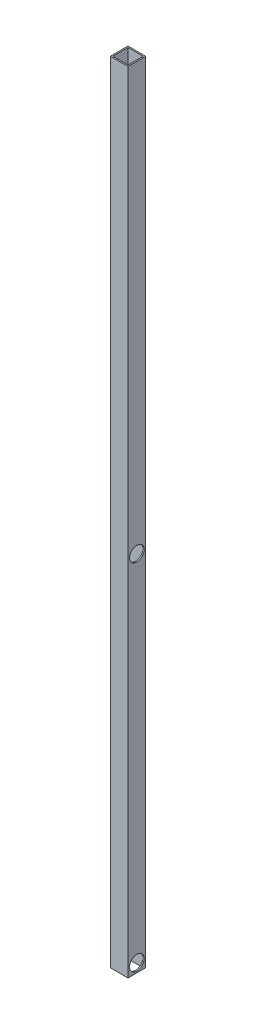
ISO-10303-21;
HEADER;
FILE_DESCRIPTION(('STEP AP214'),'2;1');
FILE_NAME('part.step','',(''),(''),'','','');
FILE_SCHEMA(('AUTOMOTIVE_DESIGN { 1 0 10303 214 1 1 1 1 }'));
ENDSEC;
DATA;
#1=APPLICATION_CONTEXT('core data for automotive mechanical design processes');
#2=APPLICATION_PROTOCOL_DEFINITION('international standard','automotive_design',2000,#1);
#3=PRODUCT_CONTEXT('',#1,'mechanical');
#4=PRODUCT('Part','Part','',(#3));
#5=PRODUCT_RELATED_PRODUCT_CATEGORY('part','',(#4));
#6=PRODUCT_DEFINITION_FORMATION('','',#4);
#7=PRODUCT_DEFINITION_CONTEXT('part definition',#1,'design');
#8=PRODUCT_DEFINITION('design','',#6,#7);
#9=PRODUCT_DEFINITION_SHAPE('','',#8);
#10=(LENGTH_UNIT() NAMED_UNIT(*) SI_UNIT(.MILLI.,.METRE.));
#11=(NAMED_UNIT(*) PLANE_ANGLE_UNIT() SI_UNIT($,.RADIAN.));
#12=(NAMED_UNIT(*) SI_UNIT($,.STERADIAN.) SOLID_ANGLE_UNIT());
#13=UNCERTAINTY_MEASURE_WITH_UNIT(LENGTH_MEASURE(1.E-05),#10,'distance_accuracy_value','');
#14=(GEOMETRIC_REPRESENTATION_CONTEXT(3) GLOBAL_UNCERTAINTY_ASSIGNED_CONTEXT((#13)) GLOBAL_UNIT_ASSIGNED_CONTEXT((#10,
#11,#12)) REPRESENTATION_CONTEXT('',''));
#15=CARTESIAN_POINT('',(0.,0.,0.));
#16=DIRECTION('',(0.,0.,1.));
#17=DIRECTION('',(1.,0.,0.));
#18=AXIS2_PLACEMENT_3D('',#15,#16,#17);
#19=CARTESIAN_POINT('',(44.45,22.225,-22.225));
#20=DIRECTION('',(1.,0.,0.));
#21=DIRECTION('',(0.,0.,-1.));
#22=AXIS2_PLACEMENT_3D('',#19,#20,#21);
#23=CYLINDRICAL_SURFACE('',#22,18.25625);
#24=CARTESIAN_POINT('',(41.275,22.225,-22.225));
#25=DIRECTION('',(1.,0.,0.));
#26=DIRECTION('',(0.,0.,-1.));
#27=AXIS2_PLACEMENT_3D('',#24,#25,#26);
#28=CIRCLE('',#27,18.25625);
#29=CARTESIAN_POINT('',(41.275,22.225,-40.48125));
#30=VERTEX_POINT('',#29);
#31=EDGE_CURVE('E19',#30,#30,#28,.T.);
#32=ORIENTED_EDGE('',*,*,#31,.F.);
#33=EDGE_LOOP('',(#32));
#34=FACE_BOUND('',#33,.T.);
#35=CARTESIAN_POINT('',(44.45,22.225,-22.225));
#36=DIRECTION('',(1.,0.,0.));
#37=DIRECTION('',(0.,0.,-1.));
#38=AXIS2_PLACEMENT_3D('',#35,#36,#37);
#39=CIRCLE('',#38,18.25625);
#40=CARTESIAN_POINT('',(44.45,22.225,-40.48125));
#41=VERTEX_POINT('',#40);
#42=EDGE_CURVE('E119',#41,#41,#39,.F.);
#43=ORIENTED_EDGE('',*,*,#42,.F.);
#44=EDGE_LOOP('',(#43));
#45=FACE_BOUND('',#44,.T.);
#46=ADVANCED_FACE('F16',(#34,#45),#23,.F.);
#47=CARTESIAN_POINT('',(44.45,911.225,-22.225));
#48=DIRECTION('',(1.,0.,0.));
#49=DIRECTION('',(0.,0.,-1.));
#50=AXIS2_PLACEMENT_3D('',#47,#48,#49);
#51=CYLINDRICAL_SURFACE('',#50,18.25625);
#52=CARTESIAN_POINT('',(41.275,911.225,-22.225));
#53=DIRECTION('',(1.,0.,0.));
#54=DIRECTION('',(0.,0.,-1.));
#55=AXIS2_PLACEMENT_3D('',#52,#53,#54);
#56=CIRCLE('',#55,18.25625);
#57=CARTESIAN_POINT('',(41.275,911.225,-40.48125));
#58=VERTEX_POINT('',#57);
#59=EDGE_CURVE('E125',#58,#58,#56,.T.);
#60=ORIENTED_EDGE('',*,*,#59,.F.);
#61=EDGE_LOOP('',(#60));
#62=FACE_BOUND('',#61,.T.);
#63=CARTESIAN_POINT('',(44.45,911.225,-22.225));
#64=DIRECTION('',(1.,0.,0.));
#65=DIRECTION('',(0.,0.,-1.));
#66=AXIS2_PLACEMENT_3D('',#63,#64,#65);
#67=CIRCLE('',#66,18.25625);
#68=CARTESIAN_POINT('',(44.45,911.225,-40.48125));
#69=VERTEX_POINT('',#68);
#70=EDGE_CURVE('E115',#69,#69,#67,.F.);
#71=ORIENTED_EDGE('',*,*,#70,.F.);
#72=EDGE_LOOP('',(#71));
#73=FACE_BOUND('',#72,.T.);
#74=ADVANCED_FACE('F152',(#62,#73),#51,.F.);
#75=CARTESIAN_POINT('',(44.45,911.225,-22.225));
#76=DIRECTION('',(1.,0.,0.));
#77=DIRECTION('',(0.,0.,-1.));
#78=AXIS2_PLACEMENT_3D('',#75,#76,#77);
#79=CYLINDRICAL_SURFACE('',#78,12.7);
#80=CARTESIAN_POINT('',(3.175,911.225,-22.225));
#81=DIRECTION('',(1.,0.,0.));
#82=DIRECTION('',(0.,0.,-1.));
#83=AXIS2_PLACEMENT_3D('',#80,#81,#82);
#84=CIRCLE('',#83,12.7);
#85=CARTESIAN_POINT('',(3.175,911.225,-34.925));
#86=VERTEX_POINT('',#85);
#87=EDGE_CURVE('E90',#86,#86,#84,.F.);
#88=ORIENTED_EDGE('',*,*,#87,.F.);
#89=EDGE_LOOP('',(#88));
#90=FACE_BOUND('',#89,.T.);
#91=CARTESIAN_POINT('',(0.,911.225,-22.225));
#92=DIRECTION('',(1.,0.,0.));
#93=DIRECTION('',(0.,0.,-1.));
#94=AXIS2_PLACEMENT_3D('',#91,#92,#93);
#95=CIRCLE('',#94,12.7);
#96=CARTESIAN_POINT('',(0.,911.225,-34.925));
#97=VERTEX_POINT('',#96);
#98=EDGE_CURVE('E130',#97,#97,#95,.T.);
#99=ORIENTED_EDGE('',*,*,#98,.F.);
#100=EDGE_LOOP('',(#99));
#101=FACE_BOUND('',#100,.T.);
#102=ADVANCED_FACE('F228',(#90,#101),#79,.F.);
#103=CARTESIAN_POINT('',(44.45,22.225,-22.225));
#104=DIRECTION('',(1.,0.,0.));
#105=DIRECTION('',(0.,0.,-1.));
#106=AXIS2_PLACEMENT_3D('',#103,#104,#105);
#107=CYLINDRICAL_SURFACE('',#106,12.7);
#108=CARTESIAN_POINT('',(3.175,22.225,-22.225));
#109=DIRECTION('',(1.,0.,0.));
#110=DIRECTION('',(0.,0.,-1.));
#111=AXIS2_PLACEMENT_3D('',#108,#109,#110);
#112=CIRCLE('',#111,12.7);
#113=CARTESIAN_POINT('',(3.175,22.225,-34.925));
#114=VERTEX_POINT('',#113);
#115=EDGE_CURVE('E122',#114,#114,#112,.F.);
#116=ORIENTED_EDGE('',*,*,#115,.F.);
#117=EDGE_LOOP('',(#116));
#118=FACE_BOUND('',#117,.T.);
#119=CARTESIAN_POINT('',(0.,22.225,-22.225));
#120=DIRECTION('',(1.,0.,0.));
#121=DIRECTION('',(0.,0.,-1.));
#122=AXIS2_PLACEMENT_3D('',#119,#120,#121);
#123=CIRCLE('',#122,12.7);
#124=CARTESIAN_POINT('',(0.,22.225,-34.925));
#125=VERTEX_POINT('',#124);
#126=EDGE_CURVE('E126',#125,#125,#123,.T.);
#127=ORIENTED_EDGE('',*,*,#126,.F.);
#128=EDGE_LOOP('',(#127));
#129=FACE_BOUND('',#128,.T.);
#130=ADVANCED_FACE('F224',(#118,#129),#107,.F.);
#131=CARTESIAN_POINT('',(44.45,0.,-44.45));
#132=DIRECTION('',(0.,0.,-1.));
#133=DIRECTION('',(-1.,0.,0.));
#134=AXIS2_PLACEMENT_3D('',#131,#132,#133);
#135=PLANE('',#134);
#136=DIRECTION('',(0.,1.,0.));
#137=VECTOR('',#136,1.);
#138=CARTESIAN_POINT('',(44.45,0.,-44.45));
#139=LINE('',#138,#137);
#140=CARTESIAN_POINT('',(44.45,0.,-44.45));
#141=VERTEX_POINT('',#140);
#142=CARTESIAN_POINT('',(44.45,1981.2,-44.45));
#143=VERTEX_POINT('',#142);
#144=EDGE_CURVE('E116',#141,#143,#139,.T.);
#145=ORIENTED_EDGE('',*,*,#144,.F.);
#146=DIRECTION('',(1.,0.,0.));
#147=VECTOR('',#146,1.);
#148=CARTESIAN_POINT('',(0.,0.,-44.45));
#149=LINE('',#148,#147);
#150=CARTESIAN_POINT('',(0.,0.,-44.45));
#151=VERTEX_POINT('',#150);
#152=EDGE_CURVE('E175',#141,#151,#149,.F.);
#153=ORIENTED_EDGE('',*,*,#152,.T.);
#154=DIRECTION('',(0.,1.,0.));
#155=VECTOR('',#154,1.);
#156=CARTESIAN_POINT('',(0.,0.,-44.45));
#157=LINE('',#156,#155);
#158=CARTESIAN_POINT('',(0.,1981.2,-44.45));
#159=VERTEX_POINT('',#158);
#160=EDGE_CURVE('E133',#159,#151,#157,.F.);
#161=ORIENTED_EDGE('',*,*,#160,.F.);
#162=DIRECTION('',(1.,0.,0.));
#163=VECTOR('',#162,1.);
#164=CARTESIAN_POINT('',(0.,1981.2,-44.45));
#165=LINE('',#164,#163);
#166=EDGE_CURVE('E107',#143,#159,#165,.F.);
#167=ORIENTED_EDGE('',*,*,#166,.F.);
#168=EDGE_LOOP('',(#145,#153,#161,#167));
#169=FACE_BOUND('',#168,.T.);
#170=ADVANCED_FACE('F221',(#169),#135,.T.);
#171=CARTESIAN_POINT('',(41.275,0.,-41.275));
#172=DIRECTION('',(-1.,0.,0.));
#173=DIRECTION('',(0.,0.,1.));
#174=AXIS2_PLACEMENT_3D('',#171,#172,#173);
#175=PLANE('',#174);
#176=ORIENTED_EDGE('',*,*,#59,.T.);
#177=EDGE_LOOP('',(#176));
#178=FACE_BOUND('',#177,.T.);
#179=ORIENTED_EDGE('',*,*,#31,.T.);
#180=EDGE_LOOP('',(#179));
#181=FACE_BOUND('',#180,.T.);
#182=DIRECTION('',(0.,1.,0.));
#183=VECTOR('',#182,1.);
#184=CARTESIAN_POINT('',(41.275,0.,-41.275));
#185=LINE('',#184,#183);
#186=CARTESIAN_POINT('',(41.275,0.,-41.275));
#187=VERTEX_POINT('',#186);
#188=CARTESIAN_POINT('',(41.275,1981.2,-41.275));
#189=VERTEX_POINT('',#188);
#190=EDGE_CURVE('E121',#187,#189,#185,.T.);
#191=ORIENTED_EDGE('',*,*,#190,.F.);
#192=DIRECTION('',(0.,0.,1.));
#193=VECTOR('',#192,1.);
#194=CARTESIAN_POINT('',(41.275,0.,0.));
#195=LINE('',#194,#193);
#196=CARTESIAN_POINT('',(41.275,0.,-3.175));
#197=VERTEX_POINT('',#196);
#198=EDGE_CURVE('E187',#187,#197,#195,.T.);
#199=ORIENTED_EDGE('',*,*,#198,.T.);
#200=DIRECTION('',(0.,1.,0.));
#201=VECTOR('',#200,1.);
#202=CARTESIAN_POINT('',(41.275,0.,-3.175));
#203=LINE('',#202,#201);
#204=CARTESIAN_POINT('',(41.275,1981.2,-3.175));
#205=VERTEX_POINT('',#204);
#206=EDGE_CURVE('E91',#205,#197,#203,.F.);
#207=ORIENTED_EDGE('',*,*,#206,.F.);
#208=DIRECTION('',(0.,0.,1.));
#209=VECTOR('',#208,1.);
#210=CARTESIAN_POINT('',(41.275,1981.2,0.));
#211=LINE('',#210,#209);
#212=EDGE_CURVE('E106',#189,#205,#211,.T.);
#213=ORIENTED_EDGE('',*,*,#212,.F.);
#214=EDGE_LOOP('',(#191,#199,#207,#213));
#215=FACE_BOUND('',#214,.T.);
#216=ADVANCED_FACE('F147',(#178,#181,#215),#175,.T.);
#217=CARTESIAN_POINT('',(41.275,0.,-3.175));
#218=DIRECTION('',(0.,0.,-1.));
#219=DIRECTION('',(-1.,0.,0.));
#220=AXIS2_PLACEMENT_3D('',#217,#218,#219);
#221=PLANE('',#220);
#222=ORIENTED_EDGE('',*,*,#206,.T.);
#223=DIRECTION('',(1.,0.,0.));
#224=VECTOR('',#223,1.);
#225=CARTESIAN_POINT('',(0.,0.,-3.175));
#226=LINE('',#225,#224);
#227=CARTESIAN_POINT('',(3.175,0.,-3.175));
#228=VERTEX_POINT('',#227);
#229=EDGE_CURVE('E87',#197,#228,#226,.F.);
#230=ORIENTED_EDGE('',*,*,#229,.T.);
#231=DIRECTION('',(0.,1.,0.));
#232=VECTOR('',#231,1.);
#233=CARTESIAN_POINT('',(3.175,0.,-3.175));
#234=LINE('',#233,#232);
#235=CARTESIAN_POINT('',(3.175,1981.2,-3.175));
#236=VERTEX_POINT('',#235);
#237=EDGE_CURVE('E79',#236,#228,#234,.F.);
#238=ORIENTED_EDGE('',*,*,#237,.F.);
#239=DIRECTION('',(1.,0.,0.));
#240=VECTOR('',#239,1.);
#241=CARTESIAN_POINT('',(0.,1981.2,-3.175));
#242=LINE('',#241,#240);
#243=EDGE_CURVE('E84',#205,#236,#242,.F.);
#244=ORIENTED_EDGE('',*,*,#243,.F.);
#245=EDGE_LOOP('',(#222,#230,#238,#244));
#246=FACE_BOUND('',#245,.T.);
#247=ADVANCED_FACE('F82',(#246),#221,.T.);
#248=CARTESIAN_POINT('',(3.175,0.,-3.175));
#249=DIRECTION('',(1.,0.,0.));
#250=DIRECTION('',(0.,0.,-1.));
#251=AXIS2_PLACEMENT_3D('',#248,#249,#250);
#252=PLANE('',#251);
#253=ORIENTED_EDGE('',*,*,#115,.T.);
#254=EDGE_LOOP('',(#253));
#255=FACE_BOUND('',#254,.T.);
#256=ORIENTED_EDGE('',*,*,#87,.T.);
#257=EDGE_LOOP('',(#256));
#258=FACE_BOUND('',#257,.T.);
#259=ORIENTED_EDGE('',*,*,#237,.T.);
#260=DIRECTION('',(0.,0.,1.));
#261=VECTOR('',#260,1.);
#262=CARTESIAN_POINT('',(3.175,0.,0.));
#263=LINE('',#262,#261);
#264=CARTESIAN_POINT('',(3.175,0.,-41.275));
#265=VERTEX_POINT('',#264);
#266=EDGE_CURVE('E184',#228,#265,#263,.F.);
#267=ORIENTED_EDGE('',*,*,#266,.T.);
#268=DIRECTION('',(0.,1.,0.));
#269=VECTOR('',#268,1.);
#270=CARTESIAN_POINT('',(3.175,0.,-41.275));
#271=LINE('',#270,#269);
#272=CARTESIAN_POINT('',(3.175,1981.2,-41.275));
#273=VERTEX_POINT('',#272);
#274=EDGE_CURVE('E97',#273,#265,#271,.F.);
#275=ORIENTED_EDGE('',*,*,#274,.F.);
#276=DIRECTION('',(0.,0.,1.));
#277=VECTOR('',#276,1.);
#278=CARTESIAN_POINT('',(3.175,1981.2,0.));
#279=LINE('',#278,#277);
#280=EDGE_CURVE('E94',#236,#273,#279,.F.);
#281=ORIENTED_EDGE('',*,*,#280,.F.);
#282=EDGE_LOOP('',(#259,#267,#275,#281));
#283=FACE_BOUND('',#282,.T.);
#284=ADVANCED_FACE('F95',(#255,#258,#283),#252,.T.);
#285=CARTESIAN_POINT('',(3.175,0.,-41.275));
#286=DIRECTION('',(0.,0.,1.));
#287=DIRECTION('',(1.,0.,0.));
#288=AXIS2_PLACEMENT_3D('',#285,#286,#287);
#289=PLANE('',#288);
#290=ORIENTED_EDGE('',*,*,#274,.T.);
#291=DIRECTION('',(1.,0.,0.));
#292=VECTOR('',#291,1.);
#293=CARTESIAN_POINT('',(0.,0.,-41.275));
#294=LINE('',#293,#292);
#295=EDGE_CURVE('E170',#265,#187,#294,.T.);
#296=ORIENTED_EDGE('',*,*,#295,.T.);
#297=ORIENTED_EDGE('',*,*,#190,.T.);
#298=DIRECTION('',(1.,0.,0.));
#299=VECTOR('',#298,1.);
#300=CARTESIAN_POINT('',(0.,1981.2,-41.275));
#301=LINE('',#300,#299);
#302=EDGE_CURVE('E101',#273,#189,#301,.T.);
#303=ORIENTED_EDGE('',*,*,#302,.F.);
#304=EDGE_LOOP('',(#290,#296,#297,#303));
#305=FACE_BOUND('',#304,.T.);
#306=ADVANCED_FACE('F158',(#305),#289,.T.);
#307=CARTESIAN_POINT('',(44.45,0.,0.));
#308=DIRECTION('',(1.,0.,0.));
#309=DIRECTION('',(0.,0.,-1.));
#310=AXIS2_PLACEMENT_3D('',#307,#308,#309);
#311=PLANE('',#310);
#312=ORIENTED_EDGE('',*,*,#70,.T.);
#313=EDGE_LOOP('',(#312));
#314=FACE_BOUND('',#313,.T.);
#315=ORIENTED_EDGE('',*,*,#42,.T.);
#316=EDGE_LOOP('',(#315));
#317=FACE_BOUND('',#316,.T.);
#318=DIRECTION('',(0.,1.,0.));
#319=VECTOR('',#318,1.);
#320=CARTESIAN_POINT('',(44.45,0.,0.));
#321=LINE('',#320,#319);
#322=CARTESIAN_POINT('',(44.45,0.,0.));
#323=VERTEX_POINT('',#322);
#324=CARTESIAN_POINT('',(44.45,1981.2,0.));
#325=VERTEX_POINT('',#324);
#326=EDGE_CURVE('E163',#323,#325,#321,.T.);
#327=ORIENTED_EDGE('',*,*,#326,.F.);
#328=DIRECTION('',(0.,0.,1.));
#329=VECTOR('',#328,1.);
#330=CARTESIAN_POINT('',(44.45,0.,0.));
#331=LINE('',#330,#329);
#332=EDGE_CURVE('E129',#323,#141,#331,.F.);
#333=ORIENTED_EDGE('',*,*,#332,.T.);
#334=ORIENTED_EDGE('',*,*,#144,.T.);
#335=DIRECTION('',(0.,0.,1.));
#336=VECTOR('',#335,1.);
#337=CARTESIAN_POINT('',(44.45,1981.2,0.));
#338=LINE('',#337,#336);
#339=EDGE_CURVE('E109',#325,#143,#338,.F.);
#340=ORIENTED_EDGE('',*,*,#339,.F.);
#341=EDGE_LOOP('',(#327,#333,#334,#340));
#342=FACE_BOUND('',#341,.T.);
#343=ADVANCED_FACE('F155',(#314,#317,#342),#311,.T.);
#344=CARTESIAN_POINT('',(0.,1981.2,0.));
#345=DIRECTION('',(0.,1.,0.));
#346=DIRECTION('',(0.,0.,1.));
#347=AXIS2_PLACEMENT_3D('',#344,#345,#346);
#348=PLANE('',#347);
#349=ORIENTED_EDGE('',*,*,#302,.T.);
#350=ORIENTED_EDGE('',*,*,#212,.T.);
#351=ORIENTED_EDGE('',*,*,#243,.T.);
#352=ORIENTED_EDGE('',*,*,#280,.T.);
#353=EDGE_LOOP('',(#349,#350,#351,#352));
#354=FACE_BOUND('',#353,.T.);
#355=DIRECTION('',(0.,0.,1.));
#356=VECTOR('',#355,1.);
#357=CARTESIAN_POINT('',(0.,1981.2,-44.45));
#358=LINE('',#357,#356);
#359=CARTESIAN_POINT('',(0.,1981.2,0.));
#360=VERTEX_POINT('',#359);
#361=EDGE_CURVE('E192',#360,#159,#358,.F.);
#362=ORIENTED_EDGE('',*,*,#361,.F.);
#363=DIRECTION('',(1.,0.,0.));
#364=VECTOR('',#363,1.);
#365=CARTESIAN_POINT('',(0.,1981.2,0.));
#366=LINE('',#365,#364);
#367=EDGE_CURVE('E169',#325,#360,#366,.F.);
#368=ORIENTED_EDGE('',*,*,#367,.F.);
#369=ORIENTED_EDGE('',*,*,#339,.T.);
#370=ORIENTED_EDGE('',*,*,#166,.T.);
#371=EDGE_LOOP('',(#362,#368,#369,#370));
#372=FACE_BOUND('',#371,.T.);
#373=ADVANCED_FACE('F103',(#354,#372),#348,.T.);
#374=CARTESIAN_POINT('',(0.,0.,-44.45));
#375=DIRECTION('',(-1.,0.,0.));
#376=DIRECTION('',(0.,0.,1.));
#377=AXIS2_PLACEMENT_3D('',#374,#375,#376);
#378=PLANE('',#377);
#379=ORIENTED_EDGE('',*,*,#126,.T.);
#380=EDGE_LOOP('',(#379));
#381=FACE_BOUND('',#380,.T.);
#382=ORIENTED_EDGE('',*,*,#98,.T.);
#383=EDGE_LOOP('',(#382));
#384=FACE_BOUND('',#383,.T.);
#385=ORIENTED_EDGE('',*,*,#160,.T.);
#386=DIRECTION('',(0.,0.,1.));
#387=VECTOR('',#386,1.);
#388=CARTESIAN_POINT('',(0.,0.,0.));
#389=LINE('',#388,#387);
#390=CARTESIAN_POINT('',(0.,0.,0.));
#391=VERTEX_POINT('',#390);
#392=EDGE_CURVE('E34',#151,#391,#389,.T.);
#393=ORIENTED_EDGE('',*,*,#392,.T.);
#394=DIRECTION('',(0.,1.,0.));
#395=VECTOR('',#394,1.);
#396=CARTESIAN_POINT('',(0.,0.,0.));
#397=LINE('',#396,#395);
#398=EDGE_CURVE('E25',#360,#391,#397,.F.);
#399=ORIENTED_EDGE('',*,*,#398,.F.);
#400=ORIENTED_EDGE('',*,*,#361,.T.);
#401=EDGE_LOOP('',(#385,#393,#399,#400));
#402=FACE_BOUND('',#401,.T.);
#403=ADVANCED_FACE('F199',(#381,#384,#402),#378,.T.);
#404=CARTESIAN_POINT('',(0.,0.,0.));
#405=DIRECTION('',(0.,1.,0.));
#406=DIRECTION('',(0.,0.,1.));
#407=AXIS2_PLACEMENT_3D('',#404,#405,#406);
#408=PLANE('',#407);
#409=ORIENTED_EDGE('',*,*,#266,.F.);
#410=ORIENTED_EDGE('',*,*,#229,.F.);
#411=ORIENTED_EDGE('',*,*,#198,.F.);
#412=ORIENTED_EDGE('',*,*,#295,.F.);
#413=EDGE_LOOP('',(#409,#410,#411,#412));
#414=FACE_BOUND('',#413,.T.);
#415=ORIENTED_EDGE('',*,*,#152,.F.);
#416=ORIENTED_EDGE('',*,*,#332,.F.);
#417=DIRECTION('',(1.,0.,0.));
#418=VECTOR('',#417,1.);
#419=CARTESIAN_POINT('',(0.,0.,0.));
#420=LINE('',#419,#418);
#421=EDGE_CURVE('E11',#391,#323,#420,.T.);
#422=ORIENTED_EDGE('',*,*,#421,.F.);
#423=ORIENTED_EDGE('',*,*,#392,.F.);
#424=EDGE_LOOP('',(#415,#416,#422,#423));
#425=FACE_BOUND('',#424,.T.);
#426=ADVANCED_FACE('F173',(#414,#425),#408,.F.);
#427=CARTESIAN_POINT('',(0.,0.,0.));
#428=DIRECTION('',(0.,0.,1.));
#429=DIRECTION('',(1.,0.,0.));
#430=AXIS2_PLACEMENT_3D('',#427,#428,#429);
#431=PLANE('',#430);
#432=ORIENTED_EDGE('',*,*,#398,.T.);
#433=ORIENTED_EDGE('',*,*,#421,.T.);
#434=ORIENTED_EDGE('',*,*,#326,.T.);
#435=ORIENTED_EDGE('',*,*,#367,.T.);
#436=EDGE_LOOP('',(#432,#433,#434,#435));
#437=FACE_BOUND('',#436,.T.);
#438=ADVANCED_FACE('F177',(#437),#431,.T.);
#439=CLOSED_SHELL('',(#46,#74,#102,#130,#170,#216,#247,#284,#306,#343,#373,#403,#426,#438));
#440=MANIFOLD_SOLID_BREP('B1',#439);
#441=ADVANCED_BREP_SHAPE_REPRESENTATION('',(#18,#440),#14);
#442=SHAPE_DEFINITION_REPRESENTATION(#9,#441);
ENDSEC;
END-ISO-10303-21;
